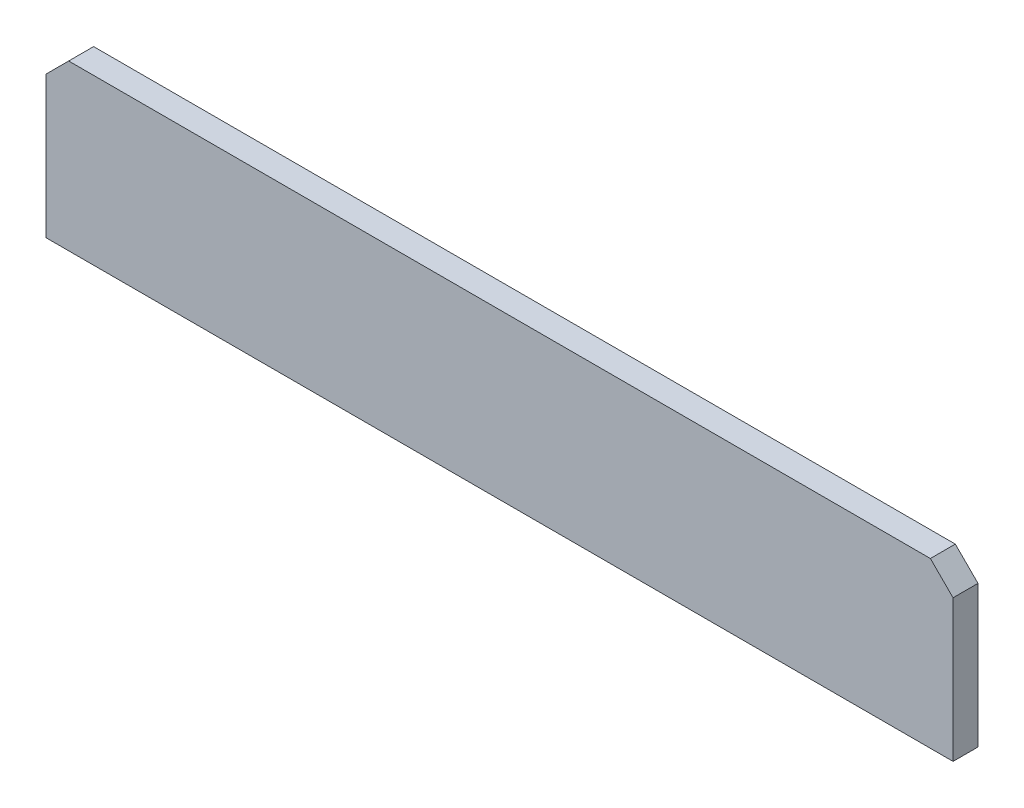
ISO-10303-21;
HEADER;
FILE_DESCRIPTION(('STEP AP214'),'2;1');
FILE_NAME('part.step','',(''),(''),'','','');
FILE_SCHEMA(('AUTOMOTIVE_DESIGN { 1 0 10303 214 1 1 1 1 }'));
ENDSEC;
DATA;
#1=APPLICATION_CONTEXT('core data for automotive mechanical design processes');
#2=APPLICATION_PROTOCOL_DEFINITION('international standard','automotive_design',2000,#1);
#3=PRODUCT_CONTEXT('',#1,'mechanical');
#4=PRODUCT('Part','Part','',(#3));
#5=PRODUCT_RELATED_PRODUCT_CATEGORY('part','',(#4));
#6=PRODUCT_DEFINITION_FORMATION('','',#4);
#7=PRODUCT_DEFINITION_CONTEXT('part definition',#1,'design');
#8=PRODUCT_DEFINITION('design','',#6,#7);
#9=PRODUCT_DEFINITION_SHAPE('','',#8);
#10=(LENGTH_UNIT() NAMED_UNIT(*) SI_UNIT(.MILLI.,.METRE.));
#11=(NAMED_UNIT(*) PLANE_ANGLE_UNIT() SI_UNIT($,.RADIAN.));
#12=(NAMED_UNIT(*) SI_UNIT($,.STERADIAN.) SOLID_ANGLE_UNIT());
#13=UNCERTAINTY_MEASURE_WITH_UNIT(LENGTH_MEASURE(1.E-05),#10,'distance_accuracy_value','');
#14=(GEOMETRIC_REPRESENTATION_CONTEXT(3) GLOBAL_UNCERTAINTY_ASSIGNED_CONTEXT((#13)) GLOBAL_UNIT_ASSIGNED_CONTEXT((#10,
#11,#12)) REPRESENTATION_CONTEXT('',''));
#15=CARTESIAN_POINT('',(0.,0.,0.));
#16=DIRECTION('',(0.,0.,1.));
#17=DIRECTION('',(1.,0.,0.));
#18=AXIS2_PLACEMENT_3D('',#15,#16,#17);
#19=CARTESIAN_POINT('',(-400.,-20.0000000000001,22.));
#20=DIRECTION('',(1.,0.,0.));
#21=DIRECTION('',(0.,0.,-1.));
#22=AXIS2_PLACEMENT_3D('',#19,#20,#21);
#23=PLANE('',#22);
#24=DIRECTION('',(0.,-1.,0.));
#25=VECTOR('',#24,1.);
#26=CARTESIAN_POINT('',(-400.,-20.0000000000001,0.));
#27=LINE('',#26,#25);
#28=CARTESIAN_POINT('',(-400.,-20.0000000000001,0.));
#29=VERTEX_POINT('',#28);
#30=CARTESIAN_POINT('',(-400.,-145.,0.));
#31=VERTEX_POINT('',#30);
#32=EDGE_CURVE('E116',#29,#31,#27,.T.);
#33=ORIENTED_EDGE('',*,*,#32,.T.);
#34=DIRECTION('',(0.,0.,-1.));
#35=VECTOR('',#34,1.);
#36=CARTESIAN_POINT('',(-400.,-145.,22.));
#37=LINE('',#36,#35);
#38=CARTESIAN_POINT('',(-400.,-145.,22.));
#39=VERTEX_POINT('',#38);
#40=EDGE_CURVE('E11',#39,#31,#37,.T.);
#41=ORIENTED_EDGE('',*,*,#40,.F.);
#42=DIRECTION('',(0.,-1.,0.));
#43=VECTOR('',#42,1.);
#44=CARTESIAN_POINT('',(-400.,-20.0000000000001,22.));
#45=LINE('',#44,#43);
#46=CARTESIAN_POINT('',(-400.,-20.0000000000001,22.));
#47=VERTEX_POINT('',#46);
#48=EDGE_CURVE('E126',#47,#39,#45,.T.);
#49=ORIENTED_EDGE('',*,*,#48,.F.);
#50=DIRECTION('',(0.,0.,-1.));
#51=VECTOR('',#50,1.);
#52=CARTESIAN_POINT('',(-400.,-20.0000000000001,22.));
#53=LINE('',#52,#51);
#54=EDGE_CURVE('E112',#47,#29,#53,.T.);
#55=ORIENTED_EDGE('',*,*,#54,.T.);
#56=EDGE_LOOP('',(#33,#41,#49,#55));
#57=FACE_BOUND('',#56,.T.);
#58=ADVANCED_FACE('F32',(#57),#23,.F.);
#59=CARTESIAN_POINT('',(400.,-145.,22.));
#60=DIRECTION('',(0.,1.,0.));
#61=DIRECTION('',(0.,0.,1.));
#62=AXIS2_PLACEMENT_3D('',#59,#60,#61);
#63=PLANE('',#62);
#64=DIRECTION('',(1.,0.,0.));
#65=VECTOR('',#64,1.);
#66=CARTESIAN_POINT('',(400.,-145.,0.));
#67=LINE('',#66,#65);
#68=CARTESIAN_POINT('',(400.,-145.,0.));
#69=VERTEX_POINT('',#68);
#70=EDGE_CURVE('E119',#31,#69,#67,.T.);
#71=ORIENTED_EDGE('',*,*,#70,.T.);
#72=DIRECTION('',(0.,0.,-1.));
#73=VECTOR('',#72,1.);
#74=CARTESIAN_POINT('',(400.,-145.,22.));
#75=LINE('',#74,#73);
#76=CARTESIAN_POINT('',(400.,-145.,22.));
#77=VERTEX_POINT('',#76);
#78=EDGE_CURVE('E40',#77,#69,#75,.T.);
#79=ORIENTED_EDGE('',*,*,#78,.F.);
#80=DIRECTION('',(1.,0.,0.));
#81=VECTOR('',#80,1.);
#82=CARTESIAN_POINT('',(400.,-145.,22.));
#83=LINE('',#82,#81);
#84=EDGE_CURVE('E85',#39,#77,#83,.T.);
#85=ORIENTED_EDGE('',*,*,#84,.F.);
#86=ORIENTED_EDGE('',*,*,#40,.T.);
#87=EDGE_LOOP('',(#71,#79,#85,#86));
#88=FACE_BOUND('',#87,.T.);
#89=ADVANCED_FACE('F150',(#88),#63,.F.);
#90=CARTESIAN_POINT('',(400.,-20.0000000000001,22.));
#91=DIRECTION('',(-1.,0.,0.));
#92=DIRECTION('',(0.,0.,1.));
#93=AXIS2_PLACEMENT_3D('',#90,#91,#92);
#94=PLANE('',#93);
#95=DIRECTION('',(0.,1.,0.));
#96=VECTOR('',#95,1.);
#97=CARTESIAN_POINT('',(400.,-20.0000000000001,0.));
#98=LINE('',#97,#96);
#99=CARTESIAN_POINT('',(400.,-20.0000000000001,0.));
#100=VERTEX_POINT('',#99);
#101=EDGE_CURVE('E121',#69,#100,#98,.T.);
#102=ORIENTED_EDGE('',*,*,#101,.T.);
#103=DIRECTION('',(0.,0.,-1.));
#104=VECTOR('',#103,1.);
#105=CARTESIAN_POINT('',(400.,-20.0000000000001,22.));
#106=LINE('',#105,#104);
#107=CARTESIAN_POINT('',(400.,-20.0000000000001,22.));
#108=VERTEX_POINT('',#107);
#109=EDGE_CURVE('E107',#108,#100,#106,.T.);
#110=ORIENTED_EDGE('',*,*,#109,.F.);
#111=DIRECTION('',(0.,1.,0.));
#112=VECTOR('',#111,1.);
#113=CARTESIAN_POINT('',(400.,-20.0000000000001,22.));
#114=LINE('',#113,#112);
#115=EDGE_CURVE('E98',#77,#108,#114,.T.);
#116=ORIENTED_EDGE('',*,*,#115,.F.);
#117=ORIENTED_EDGE('',*,*,#78,.T.);
#118=EDGE_LOOP('',(#102,#110,#116,#117));
#119=FACE_BOUND('',#118,.T.);
#120=ADVANCED_FACE('F132',(#119),#94,.F.);
#121=CARTESIAN_POINT('',(400.,-20.0000000000001,22.));
#122=DIRECTION('',(-0.707106781186547,-0.707106781186548,0.));
#123=DIRECTION('',(0.707106781186548,-0.707106781186547,0.));
#124=AXIS2_PLACEMENT_3D('',#121,#122,#123);
#125=PLANE('',#124);
#126=DIRECTION('',(-0.707106781186548,0.707106781186547,0.));
#127=VECTOR('',#126,1.);
#128=CARTESIAN_POINT('',(400.,-20.0000000000001,0.));
#129=LINE('',#128,#127);
#130=CARTESIAN_POINT('',(380.,0.,0.));
#131=VERTEX_POINT('',#130);
#132=EDGE_CURVE('E106',#100,#131,#129,.T.);
#133=ORIENTED_EDGE('',*,*,#132,.T.);
#134=DIRECTION('',(0.,0.,-1.));
#135=VECTOR('',#134,1.);
#136=CARTESIAN_POINT('',(380.,0.,22.));
#137=LINE('',#136,#135);
#138=CARTESIAN_POINT('',(380.,0.,22.));
#139=VERTEX_POINT('',#138);
#140=EDGE_CURVE('E103',#139,#131,#137,.T.);
#141=ORIENTED_EDGE('',*,*,#140,.F.);
#142=DIRECTION('',(-0.707106781186548,0.707106781186547,0.));
#143=VECTOR('',#142,1.);
#144=CARTESIAN_POINT('',(400.,-20.0000000000001,22.));
#145=LINE('',#144,#143);
#146=EDGE_CURVE('E92',#108,#139,#145,.T.);
#147=ORIENTED_EDGE('',*,*,#146,.F.);
#148=ORIENTED_EDGE('',*,*,#109,.T.);
#149=EDGE_LOOP('',(#133,#141,#147,#148));
#150=FACE_BOUND('',#149,.T.);
#151=ADVANCED_FACE('F104',(#150),#125,.F.);
#152=CARTESIAN_POINT('',(380.,0.,22.));
#153=DIRECTION('',(0.,-1.,0.));
#154=DIRECTION('',(0.,0.,-1.));
#155=AXIS2_PLACEMENT_3D('',#152,#153,#154);
#156=PLANE('',#155);
#157=DIRECTION('',(-1.,0.,0.));
#158=VECTOR('',#157,1.);
#159=CARTESIAN_POINT('',(380.,0.,0.));
#160=LINE('',#159,#158);
#161=CARTESIAN_POINT('',(-380.,0.,0.));
#162=VERTEX_POINT('',#161);
#163=EDGE_CURVE('E71',#131,#162,#160,.T.);
#164=ORIENTED_EDGE('',*,*,#163,.T.);
#165=DIRECTION('',(0.,0.,-1.));
#166=VECTOR('',#165,1.);
#167=CARTESIAN_POINT('',(-380.,0.,22.));
#168=LINE('',#167,#166);
#169=CARTESIAN_POINT('',(-380.,0.,22.));
#170=VERTEX_POINT('',#169);
#171=EDGE_CURVE('E108',#170,#162,#168,.T.);
#172=ORIENTED_EDGE('',*,*,#171,.F.);
#173=DIRECTION('',(-1.,0.,0.));
#174=VECTOR('',#173,1.);
#175=CARTESIAN_POINT('',(380.,0.,22.));
#176=LINE('',#175,#174);
#177=EDGE_CURVE('E96',#139,#170,#176,.T.);
#178=ORIENTED_EDGE('',*,*,#177,.F.);
#179=ORIENTED_EDGE('',*,*,#140,.T.);
#180=EDGE_LOOP('',(#164,#172,#178,#179));
#181=FACE_BOUND('',#180,.T.);
#182=ADVANCED_FACE('F110',(#181),#156,.F.);
#183=CARTESIAN_POINT('',(-380.,0.,22.));
#184=DIRECTION('',(0.707106781186547,-0.707106781186548,0.));
#185=DIRECTION('',(0.707106781186548,0.707106781186547,0.));
#186=AXIS2_PLACEMENT_3D('',#183,#184,#185);
#187=PLANE('',#186);
#188=DIRECTION('',(-0.707106781186548,-0.707106781186547,0.));
#189=VECTOR('',#188,1.);
#190=CARTESIAN_POINT('',(-380.,0.,0.));
#191=LINE('',#190,#189);
#192=EDGE_CURVE('E77',#162,#29,#191,.T.);
#193=ORIENTED_EDGE('',*,*,#192,.T.);
#194=ORIENTED_EDGE('',*,*,#54,.F.);
#195=DIRECTION('',(-0.707106781186548,-0.707106781186547,0.));
#196=VECTOR('',#195,1.);
#197=CARTESIAN_POINT('',(-380.,0.,22.));
#198=LINE('',#197,#196);
#199=EDGE_CURVE('E48',#170,#47,#198,.T.);
#200=ORIENTED_EDGE('',*,*,#199,.F.);
#201=ORIENTED_EDGE('',*,*,#171,.T.);
#202=EDGE_LOOP('',(#193,#194,#200,#201));
#203=FACE_BOUND('',#202,.T.);
#204=ADVANCED_FACE('F139',(#203),#187,.F.);
#205=CARTESIAN_POINT('',(-400.,-145.,22.));
#206=DIRECTION('',(0.,0.,-1.));
#207=DIRECTION('',(-1.,0.,0.));
#208=AXIS2_PLACEMENT_3D('',#205,#206,#207);
#209=PLANE('',#208);
#210=ORIENTED_EDGE('',*,*,#48,.T.);
#211=ORIENTED_EDGE('',*,*,#84,.T.);
#212=ORIENTED_EDGE('',*,*,#115,.T.);
#213=ORIENTED_EDGE('',*,*,#146,.T.);
#214=ORIENTED_EDGE('',*,*,#177,.T.);
#215=ORIENTED_EDGE('',*,*,#199,.T.);
#216=EDGE_LOOP('',(#210,#211,#212,#213,#214,#215));
#217=FACE_BOUND('',#216,.T.);
#218=ADVANCED_FACE('F94',(#217),#209,.F.);
#219=CARTESIAN_POINT('',(-400.,-145.,0.));
#220=DIRECTION('',(0.,0.,-1.));
#221=DIRECTION('',(-1.,0.,0.));
#222=AXIS2_PLACEMENT_3D('',#219,#220,#221);
#223=PLANE('',#222);
#224=ORIENTED_EDGE('',*,*,#32,.F.);
#225=ORIENTED_EDGE('',*,*,#192,.F.);
#226=ORIENTED_EDGE('',*,*,#163,.F.);
#227=ORIENTED_EDGE('',*,*,#132,.F.);
#228=ORIENTED_EDGE('',*,*,#101,.F.);
#229=ORIENTED_EDGE('',*,*,#70,.F.);
#230=EDGE_LOOP('',(#224,#225,#226,#227,#228,#229));
#231=FACE_BOUND('',#230,.T.);
#232=ADVANCED_FACE('F135',(#231),#223,.T.);
#233=CLOSED_SHELL('',(#58,#89,#120,#151,#182,#204,#218,#232));
#234=MANIFOLD_SOLID_BREP('B2',#233);
#235=ADVANCED_BREP_SHAPE_REPRESENTATION('',(#18,#234),#14);
#236=SHAPE_DEFINITION_REPRESENTATION(#9,#235);
ENDSEC;
END-ISO-10303-21;
